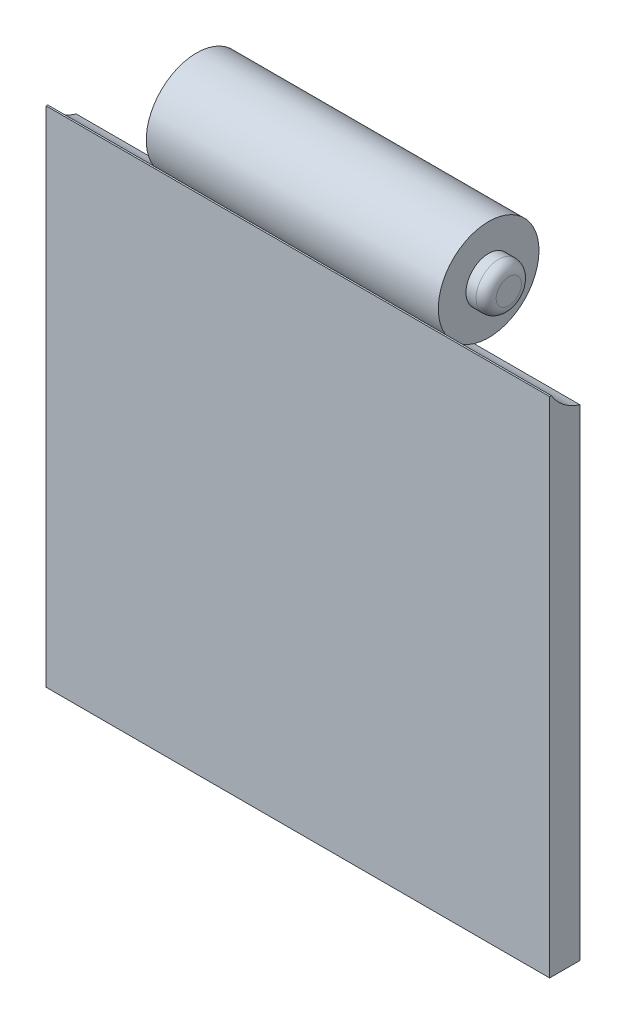
ISO-10303-21;
HEADER;
FILE_DESCRIPTION(('STEP AP214'),'2;1');
FILE_NAME('part.step','',(''),(''),'','','');
FILE_SCHEMA(('AUTOMOTIVE_DESIGN { 1 0 10303 214 1 1 1 1 }'));
ENDSEC;
DATA;
#1=APPLICATION_CONTEXT('core data for automotive mechanical design processes');
#2=APPLICATION_PROTOCOL_DEFINITION('international standard','automotive_design',2000,#1);
#3=PRODUCT_CONTEXT('',#1,'mechanical');
#4=PRODUCT('Part','Part','',(#3));
#5=PRODUCT_RELATED_PRODUCT_CATEGORY('part','',(#4));
#6=PRODUCT_DEFINITION_FORMATION('','',#4);
#7=PRODUCT_DEFINITION_CONTEXT('part definition',#1,'design');
#8=PRODUCT_DEFINITION('design','',#6,#7);
#9=PRODUCT_DEFINITION_SHAPE('','',#8);
#10=(LENGTH_UNIT() NAMED_UNIT(*) SI_UNIT(.MILLI.,.METRE.));
#11=(NAMED_UNIT(*) PLANE_ANGLE_UNIT() SI_UNIT($,.RADIAN.));
#12=(NAMED_UNIT(*) SI_UNIT($,.STERADIAN.) SOLID_ANGLE_UNIT());
#13=UNCERTAINTY_MEASURE_WITH_UNIT(LENGTH_MEASURE(1.E-05),#10,'distance_accuracy_value','');
#14=(GEOMETRIC_REPRESENTATION_CONTEXT(3) GLOBAL_UNCERTAINTY_ASSIGNED_CONTEXT((#13)) GLOBAL_UNIT_ASSIGNED_CONTEXT((#10,
#11,#12)) REPRESENTATION_CONTEXT('',''));
#15=CARTESIAN_POINT('',(0.,0.,0.));
#16=DIRECTION('',(0.,0.,1.));
#17=DIRECTION('',(1.,0.,0.));
#18=AXIS2_PLACEMENT_3D('',#15,#16,#17);
#19=CARTESIAN_POINT('',(-25.,50.,-1.5));
#20=DIRECTION('',(0.,0.,1.));
#21=DIRECTION('',(1.,0.,0.));
#22=AXIS2_PLACEMENT_3D('',#19,#20,#21);
#23=PLANE('',#22);
#24=DIRECTION('',(0.,-1.,0.));
#25=VECTOR('',#24,1.);
#26=CARTESIAN_POINT('',(-25.,50.,-1.5));
#27=LINE('',#26,#25);
#28=CARTESIAN_POINT('',(-25.,47.8014263661463,-1.5));
#29=VERTEX_POINT('',#28);
#30=CARTESIAN_POINT('',(-25.,0.,-1.5));
#31=VERTEX_POINT('',#30);
#32=EDGE_CURVE('E110',#29,#31,#27,.T.);
#33=ORIENTED_EDGE('',*,*,#32,.F.);
#34=DIRECTION('',(1.,0.,0.));
#35=VECTOR('',#34,1.);
#36=CARTESIAN_POINT('',(-25.,47.8014263661463,-1.5));
#37=LINE('',#36,#35);
#38=CARTESIAN_POINT('',(-14.5,47.8014263661463,-1.5));
#39=VERTEX_POINT('',#38);
#40=EDGE_CURVE('E225',#29,#39,#37,.T.);
#41=ORIENTED_EDGE('',*,*,#40,.T.);
#42=DIRECTION('',(1.,0.,0.));
#43=VECTOR('',#42,1.);
#44=CARTESIAN_POINT('',(-14.5,47.8014263661463,-1.5));
#45=LINE('',#44,#43);
#46=CARTESIAN_POINT('',(14.5,47.8014263661463,-1.5));
#47=VERTEX_POINT('',#46);
#48=EDGE_CURVE('E99',#39,#47,#45,.T.);
#49=ORIENTED_EDGE('',*,*,#48,.T.);
#50=DIRECTION('',(-1.,0.,0.));
#51=VECTOR('',#50,1.);
#52=CARTESIAN_POINT('',(25.,47.8014263661463,-1.5));
#53=LINE('',#52,#51);
#54=CARTESIAN_POINT('',(25.,47.8014263661463,-1.5));
#55=VERTEX_POINT('',#54);
#56=EDGE_CURVE('E206',#55,#47,#53,.T.);
#57=ORIENTED_EDGE('',*,*,#56,.F.);
#58=DIRECTION('',(0.,-1.,0.));
#59=VECTOR('',#58,1.);
#60=CARTESIAN_POINT('',(25.,50.,-1.5));
#61=LINE('',#60,#59);
#62=CARTESIAN_POINT('',(25.,0.,-1.5));
#63=VERTEX_POINT('',#62);
#64=EDGE_CURVE('E112',#55,#63,#61,.T.);
#65=ORIENTED_EDGE('',*,*,#64,.T.);
#66=DIRECTION('',(-1.,0.,0.));
#67=VECTOR('',#66,1.);
#68=CARTESIAN_POINT('',(-25.,0.,-1.5));
#69=LINE('',#68,#67);
#70=EDGE_CURVE('E98',#63,#31,#69,.T.);
#71=ORIENTED_EDGE('',*,*,#70,.T.);
#72=EDGE_LOOP('',(#33,#41,#49,#57,#65,#71));
#73=FACE_BOUND('',#72,.T.);
#74=ADVANCED_FACE('F33',(#73),#23,.F.);
#75=CARTESIAN_POINT('',(0.,50.,0.));
#76=DIRECTION('',(0.,1.,0.));
#77=DIRECTION('',(0.,0.,1.));
#78=AXIS2_PLACEMENT_3D('',#75,#76,#77);
#79=PLANE('',#78);
#80=DIRECTION('',(1.,0.,0.));
#81=VECTOR('',#80,1.);
#82=CARTESIAN_POINT('',(-25.,50.,1.33685604506207));
#83=LINE('',#82,#81);
#84=CARTESIAN_POINT('',(-25.,50.,1.33685604506207));
#85=VERTEX_POINT('',#84);
#86=CARTESIAN_POINT('',(-14.5,50.,1.33685604506207));
#87=VERTEX_POINT('',#86);
#88=EDGE_CURVE('E197',#85,#87,#83,.T.);
#89=ORIENTED_EDGE('',*,*,#88,.F.);
#90=DIRECTION('',(0.,0.,1.));
#91=VECTOR('',#90,1.);
#92=CARTESIAN_POINT('',(-25.,50.,-1.5));
#93=LINE('',#92,#91);
#94=CARTESIAN_POINT('',(-25.,50.,1.5));
#95=VERTEX_POINT('',#94);
#96=EDGE_CURVE('E191',#85,#95,#93,.T.);
#97=ORIENTED_EDGE('',*,*,#96,.T.);
#98=DIRECTION('',(1.,0.,0.));
#99=VECTOR('',#98,1.);
#100=CARTESIAN_POINT('',(-25.,50.,1.5));
#101=LINE('',#100,#99);
#102=CARTESIAN_POINT('',(25.,50.,1.5));
#103=VERTEX_POINT('',#102);
#104=EDGE_CURVE('E57',#95,#103,#101,.T.);
#105=ORIENTED_EDGE('',*,*,#104,.T.);
#106=DIRECTION('',(0.,0.,-1.));
#107=VECTOR('',#106,1.);
#108=CARTESIAN_POINT('',(25.,50.,-1.5));
#109=LINE('',#108,#107);
#110=CARTESIAN_POINT('',(25.,50.,1.33685604506206));
#111=VERTEX_POINT('',#110);
#112=EDGE_CURVE('E86',#103,#111,#109,.T.);
#113=ORIENTED_EDGE('',*,*,#112,.T.);
#114=DIRECTION('',(-1.,0.,0.));
#115=VECTOR('',#114,1.);
#116=CARTESIAN_POINT('',(25.,50.,1.33685604506207));
#117=LINE('',#116,#115);
#118=CARTESIAN_POINT('',(14.5,50.,1.33685604506207));
#119=VERTEX_POINT('',#118);
#120=EDGE_CURVE('E48',#111,#119,#117,.T.);
#121=ORIENTED_EDGE('',*,*,#120,.T.);
#122=DIRECTION('',(1.,0.,0.));
#123=VECTOR('',#122,1.);
#124=CARTESIAN_POINT('',(-14.5,50.,1.33685604506207));
#125=LINE('',#124,#123);
#126=EDGE_CURVE('E114',#87,#119,#125,.T.);
#127=ORIENTED_EDGE('',*,*,#126,.F.);
#128=EDGE_LOOP('',(#89,#97,#105,#113,#121,#127));
#129=FACE_BOUND('',#128,.T.);
#130=ADVANCED_FACE('F142',(#129),#79,.T.);
#131=CARTESIAN_POINT('',(25.,50.,-1.5));
#132=DIRECTION('',(-1.,0.,0.));
#133=DIRECTION('',(0.,0.,1.));
#134=AXIS2_PLACEMENT_3D('',#131,#132,#133);
#135=PLANE('',#134);
#136=CARTESIAN_POINT('',(25.,52.5894672323785,-2.94036962731462));
#137=DIRECTION('',(1.,0.,0.));
#138=DIRECTION('',(0.,0.,-1.));
#139=AXIS2_PLACEMENT_3D('',#136,#137,#138);
#140=CIRCLE('',#139,5.);
#141=EDGE_CURVE('E207',#111,#55,#140,.T.);
#142=ORIENTED_EDGE('',*,*,#141,.F.);
#143=ORIENTED_EDGE('',*,*,#112,.F.);
#144=DIRECTION('',(0.,-1.,0.));
#145=VECTOR('',#144,1.);
#146=CARTESIAN_POINT('',(25.,50.,1.5));
#147=LINE('',#146,#145);
#148=CARTESIAN_POINT('',(25.,0.,1.5));
#149=VERTEX_POINT('',#148);
#150=EDGE_CURVE('E79',#103,#149,#147,.T.);
#151=ORIENTED_EDGE('',*,*,#150,.T.);
#152=DIRECTION('',(0.,0.,-1.));
#153=VECTOR('',#152,1.);
#154=CARTESIAN_POINT('',(25.,0.,-1.5));
#155=LINE('',#154,#153);
#156=EDGE_CURVE('E93',#149,#63,#155,.T.);
#157=ORIENTED_EDGE('',*,*,#156,.T.);
#158=ORIENTED_EDGE('',*,*,#64,.F.);
#159=EDGE_LOOP('',(#142,#143,#151,#157,#158));
#160=FACE_BOUND('',#159,.T.);
#161=ADVANCED_FACE('F91',(#160),#135,.F.);
#162=CARTESIAN_POINT('',(14.5,52.5894672323785,-2.94036962731462));
#163=DIRECTION('',(1.,0.,0.));
#164=DIRECTION('',(0.,0.,-1.));
#165=AXIS2_PLACEMENT_3D('',#162,#163,#164);
#166=PLANE('',#165);
#167=CARTESIAN_POINT('',(14.5,52.5894672323785,-2.94036962731462));
#168=DIRECTION('',(1.,0.,0.));
#169=DIRECTION('',(0.,0.,-1.));
#170=AXIS2_PLACEMENT_3D('',#167,#168,#169);
#171=CIRCLE('',#170,5.);
#172=EDGE_CURVE('E216',#119,#47,#171,.T.);
#173=ORIENTED_EDGE('',*,*,#172,.T.);
#174=CARTESIAN_POINT('',(14.5,52.5894672323785,-2.94036962731462));
#175=DIRECTION('',(1.,0.,0.));
#176=DIRECTION('',(0.,0.,-1.));
#177=AXIS2_PLACEMENT_3D('',#174,#175,#176);
#178=CIRCLE('',#177,5.);
#179=EDGE_CURVE('E180',#47,#119,#178,.T.);
#180=ORIENTED_EDGE('',*,*,#179,.T.);
#181=EDGE_LOOP('',(#173,#180));
#182=FACE_BOUND('',#181,.T.);
#183=CARTESIAN_POINT('',(14.5,52.5894672323785,-2.94036962731462));
#184=DIRECTION('',(1.,0.,0.));
#185=DIRECTION('',(0.,0.,-1.));
#186=AXIS2_PLACEMENT_3D('',#183,#184,#185);
#187=CIRCLE('',#186,2.25);
#188=CARTESIAN_POINT('',(14.5,52.5894672323785,-5.19036962731462));
#189=VERTEX_POINT('',#188);
#190=EDGE_CURVE('E178',#189,#189,#187,.T.);
#191=ORIENTED_EDGE('',*,*,#190,.F.);
#192=EDGE_LOOP('',(#191));
#193=FACE_BOUND('',#192,.T.);
#194=ADVANCED_FACE('F155',(#182,#193),#166,.T.);
#195=CARTESIAN_POINT('',(-25.,50.,-1.5));
#196=DIRECTION('',(1.,0.,0.));
#197=DIRECTION('',(0.,0.,-1.));
#198=AXIS2_PLACEMENT_3D('',#195,#196,#197);
#199=PLANE('',#198);
#200=ORIENTED_EDGE('',*,*,#96,.F.);
#201=CARTESIAN_POINT('',(-25.,52.5894672323785,-2.94036962731462));
#202=DIRECTION('',(1.,0.,0.));
#203=DIRECTION('',(0.,0.,-1.));
#204=AXIS2_PLACEMENT_3D('',#201,#202,#203);
#205=CIRCLE('',#204,5.);
#206=EDGE_CURVE('E202',#85,#29,#205,.T.);
#207=ORIENTED_EDGE('',*,*,#206,.T.);
#208=ORIENTED_EDGE('',*,*,#32,.T.);
#209=DIRECTION('',(0.,0.,1.));
#210=VECTOR('',#209,1.);
#211=CARTESIAN_POINT('',(-25.,0.,-1.5));
#212=LINE('',#211,#210);
#213=CARTESIAN_POINT('',(-25.,0.,1.5));
#214=VERTEX_POINT('',#213);
#215=EDGE_CURVE('E87',#31,#214,#212,.T.);
#216=ORIENTED_EDGE('',*,*,#215,.T.);
#217=DIRECTION('',(0.,-1.,0.));
#218=VECTOR('',#217,1.);
#219=CARTESIAN_POINT('',(-25.,50.,1.5));
#220=LINE('',#219,#218);
#221=EDGE_CURVE('E82',#95,#214,#220,.T.);
#222=ORIENTED_EDGE('',*,*,#221,.F.);
#223=EDGE_LOOP('',(#200,#207,#208,#216,#222));
#224=FACE_BOUND('',#223,.T.);
#225=ADVANCED_FACE('F152',(#224),#199,.F.);
#226=CARTESIAN_POINT('',(-25.,50.,1.5));
#227=DIRECTION('',(0.,0.,-1.));
#228=DIRECTION('',(-1.,0.,0.));
#229=AXIS2_PLACEMENT_3D('',#226,#227,#228);
#230=PLANE('',#229);
#231=DIRECTION('',(1.,0.,0.));
#232=VECTOR('',#231,1.);
#233=CARTESIAN_POINT('',(-25.,0.,1.5));
#234=LINE('',#233,#232);
#235=EDGE_CURVE('E76',#214,#149,#234,.T.);
#236=ORIENTED_EDGE('',*,*,#235,.T.);
#237=ORIENTED_EDGE('',*,*,#150,.F.);
#238=ORIENTED_EDGE('',*,*,#104,.F.);
#239=ORIENTED_EDGE('',*,*,#221,.T.);
#240=EDGE_LOOP('',(#236,#237,#238,#239));
#241=FACE_BOUND('',#240,.T.);
#242=ADVANCED_FACE('F78',(#241),#230,.F.);
#243=CARTESIAN_POINT('',(0.,0.,0.));
#244=DIRECTION('',(0.,1.,0.));
#245=DIRECTION('',(0.,0.,1.));
#246=AXIS2_PLACEMENT_3D('',#243,#244,#245);
#247=PLANE('',#246);
#248=ORIENTED_EDGE('',*,*,#156,.F.);
#249=ORIENTED_EDGE('',*,*,#235,.F.);
#250=ORIENTED_EDGE('',*,*,#215,.F.);
#251=ORIENTED_EDGE('',*,*,#70,.F.);
#252=EDGE_LOOP('',(#248,#249,#250,#251));
#253=FACE_BOUND('',#252,.T.);
#254=ADVANCED_FACE('F96',(#253),#247,.F.);
#255=CARTESIAN_POINT('',(-14.5,52.5894672323785,-2.94036962731462));
#256=DIRECTION('',(1.,0.,0.));
#257=DIRECTION('',(0.,0.,-1.));
#258=AXIS2_PLACEMENT_3D('',#255,#256,#257);
#259=CYLINDRICAL_SURFACE('',#258,5.);
#260=ORIENTED_EDGE('',*,*,#48,.F.);
#261=CARTESIAN_POINT('',(-14.5,52.5894672323785,-2.94036962731462));
#262=DIRECTION('',(1.,0.,0.));
#263=DIRECTION('',(0.,0.,-1.));
#264=AXIS2_PLACEMENT_3D('',#261,#262,#263);
#265=CIRCLE('',#264,5.);
#266=EDGE_CURVE('E103',#39,#87,#265,.T.);
#267=ORIENTED_EDGE('',*,*,#266,.T.);
#268=ORIENTED_EDGE('',*,*,#126,.T.);
#269=ORIENTED_EDGE('',*,*,#179,.F.);
#270=EDGE_LOOP('',(#260,#267,#268,#269));
#271=FACE_BOUND('',#270,.T.);
#272=ADVANCED_FACE('F233',(#271),#259,.T.);
#273=CARTESIAN_POINT('',(-14.5,52.5894672323785,-2.94036962731462));
#274=DIRECTION('',(1.,0.,0.));
#275=DIRECTION('',(0.,0.,-1.));
#276=AXIS2_PLACEMENT_3D('',#273,#274,#275);
#277=PLANE('',#276);
#278=CARTESIAN_POINT('',(-14.5,52.5894672323785,-2.94036962731462));
#279=DIRECTION('',(1.,0.,0.));
#280=DIRECTION('',(0.,0.,-1.));
#281=AXIS2_PLACEMENT_3D('',#278,#279,#280);
#282=CIRCLE('',#281,2.25);
#283=CARTESIAN_POINT('',(-14.5,52.5894672323785,-5.19036962731462));
#284=VERTEX_POINT('',#283);
#285=EDGE_CURVE('E181',#284,#284,#282,.T.);
#286=ORIENTED_EDGE('',*,*,#285,.T.);
#287=EDGE_LOOP('',(#286));
#288=FACE_BOUND('',#287,.T.);
#289=ORIENTED_EDGE('',*,*,#266,.F.);
#290=CARTESIAN_POINT('',(-14.5,52.5894672323785,-2.94036962731462));
#291=DIRECTION('',(1.,0.,0.));
#292=DIRECTION('',(0.,0.,-1.));
#293=AXIS2_PLACEMENT_3D('',#290,#291,#292);
#294=CIRCLE('',#293,5.);
#295=EDGE_CURVE('E224',#87,#39,#294,.T.);
#296=ORIENTED_EDGE('',*,*,#295,.F.);
#297=EDGE_LOOP('',(#289,#296));
#298=FACE_BOUND('',#297,.T.);
#299=ADVANCED_FACE('F174',(#288,#298),#277,.F.);
#300=CARTESIAN_POINT('',(16.5,52.5894672323785,-2.94036962731462));
#301=DIRECTION('',(-1.,0.,0.));
#302=DIRECTION('',(0.,0.,1.));
#303=AXIS2_PLACEMENT_3D('',#300,#301,#302);
#304=CYLINDRICAL_SURFACE('',#303,2.25);
#305=CARTESIAN_POINT('',(15.5,52.5894672323785,-2.94036962731462));
#306=DIRECTION('',(1.,0.,0.));
#307=DIRECTION('',(0.,0.,-1.));
#308=AXIS2_PLACEMENT_3D('',#305,#306,#307);
#309=CIRCLE('',#308,2.25);
#310=CARTESIAN_POINT('',(15.5,52.5894672323785,-5.19036962731462));
#311=VERTEX_POINT('',#310);
#312=EDGE_CURVE('E120',#311,#311,#309,.F.);
#313=ORIENTED_EDGE('',*,*,#312,.T.);
#314=EDGE_LOOP('',(#313));
#315=FACE_BOUND('',#314,.T.);
#316=ORIENTED_EDGE('',*,*,#190,.T.);
#317=EDGE_LOOP('',(#316));
#318=FACE_BOUND('',#317,.T.);
#319=ADVANCED_FACE('F165',(#315,#318),#304,.T.);
#320=CARTESIAN_POINT('',(16.5,52.5894672323785,-2.94036962731462));
#321=DIRECTION('',(1.,0.,0.));
#322=DIRECTION('',(0.,0.,-1.));
#323=AXIS2_PLACEMENT_3D('',#320,#321,#322);
#324=PLANE('',#323);
#325=CARTESIAN_POINT('',(16.5,52.5894672323785,-2.94036962731462));
#326=DIRECTION('',(1.,0.,0.));
#327=DIRECTION('',(0.,0.,-1.));
#328=AXIS2_PLACEMENT_3D('',#325,#326,#327);
#329=CIRCLE('',#328,1.25);
#330=CARTESIAN_POINT('',(16.5,52.5894672323785,-4.19036962731462));
#331=VERTEX_POINT('',#330);
#332=EDGE_CURVE('E117',#331,#331,#329,.T.);
#333=ORIENTED_EDGE('',*,*,#332,.T.);
#334=EDGE_LOOP('',(#333));
#335=FACE_BOUND('',#334,.T.);
#336=ADVANCED_FACE('F158',(#335),#324,.T.);
#337=CARTESIAN_POINT('',(15.5,52.5894672323785,-2.94036962731462));
#338=DIRECTION('',(1.,0.,0.));
#339=DIRECTION('',(0.,0.,-1.));
#340=AXIS2_PLACEMENT_3D('',#337,#338,#339);
#341=TOROIDAL_SURFACE('',#340,1.25,1.);
#342=ORIENTED_EDGE('',*,*,#312,.F.);
#343=EDGE_LOOP('',(#342));
#344=FACE_BOUND('',#343,.T.);
#345=ORIENTED_EDGE('',*,*,#332,.F.);
#346=EDGE_LOOP('',(#345));
#347=FACE_BOUND('',#346,.T.);
#348=ADVANCED_FACE('F156',(#344,#347),#341,.T.);
#349=CARTESIAN_POINT('',(-16.5,52.5894672323785,-2.94036962731462));
#350=DIRECTION('',(1.,0.,0.));
#351=DIRECTION('',(0.,0.,-1.));
#352=AXIS2_PLACEMENT_3D('',#349,#350,#351);
#353=CYLINDRICAL_SURFACE('',#352,2.25);
#354=CARTESIAN_POINT('',(-15.5,52.5894672323785,-2.94036962731462));
#355=DIRECTION('',(-1.,0.,0.));
#356=DIRECTION('',(0.,0.,1.));
#357=AXIS2_PLACEMENT_3D('',#354,#355,#356);
#358=CIRCLE('',#357,2.25);
#359=CARTESIAN_POINT('',(-15.5,52.5894672323785,-0.690369627314624));
#360=VERTEX_POINT('',#359);
#361=EDGE_CURVE('E41',#360,#360,#358,.F.);
#362=ORIENTED_EDGE('',*,*,#361,.T.);
#363=EDGE_LOOP('',(#362));
#364=FACE_BOUND('',#363,.T.);
#365=ORIENTED_EDGE('',*,*,#285,.F.);
#366=EDGE_LOOP('',(#365));
#367=FACE_BOUND('',#366,.T.);
#368=ADVANCED_FACE('F125',(#364,#367),#353,.T.);
#369=CARTESIAN_POINT('',(-16.5,52.5894672323785,-2.94036962731462));
#370=DIRECTION('',(-1.,0.,0.));
#371=DIRECTION('',(0.,0.,-1.));
#372=AXIS2_PLACEMENT_3D('',#369,#370,#371);
#373=PLANE('',#372);
#374=CARTESIAN_POINT('',(-16.5,52.5894672323785,-2.94036962731462));
#375=DIRECTION('',(-1.,0.,0.));
#376=DIRECTION('',(0.,0.,1.));
#377=AXIS2_PLACEMENT_3D('',#374,#375,#376);
#378=CIRCLE('',#377,1.25);
#379=CARTESIAN_POINT('',(-16.5,52.5894672323785,-1.69036962731462));
#380=VERTEX_POINT('',#379);
#381=EDGE_CURVE('E11',#380,#380,#378,.T.);
#382=ORIENTED_EDGE('',*,*,#381,.T.);
#383=EDGE_LOOP('',(#382));
#384=FACE_BOUND('',#383,.T.);
#385=ADVANCED_FACE('F130',(#384),#373,.T.);
#386=CARTESIAN_POINT('',(-15.5,52.5894672323785,-2.94036962731462));
#387=DIRECTION('',(-1.,0.,0.));
#388=DIRECTION('',(0.,0.,1.));
#389=AXIS2_PLACEMENT_3D('',#386,#387,#388);
#390=TOROIDAL_SURFACE('',#389,1.25,1.);
#391=ORIENTED_EDGE('',*,*,#381,.F.);
#392=EDGE_LOOP('',(#391));
#393=FACE_BOUND('',#392,.T.);
#394=ORIENTED_EDGE('',*,*,#361,.F.);
#395=EDGE_LOOP('',(#394));
#396=FACE_BOUND('',#395,.T.);
#397=ADVANCED_FACE('F35',(#393,#396),#390,.T.);
#398=CARTESIAN_POINT('',(25.,52.5894672323785,-2.94036962731462));
#399=DIRECTION('',(-1.,0.,0.));
#400=DIRECTION('',(0.,0.,1.));
#401=AXIS2_PLACEMENT_3D('',#398,#399,#400);
#402=CYLINDRICAL_SURFACE('',#401,5.);
#403=ORIENTED_EDGE('',*,*,#172,.F.);
#404=ORIENTED_EDGE('',*,*,#120,.F.);
#405=ORIENTED_EDGE('',*,*,#141,.T.);
#406=ORIENTED_EDGE('',*,*,#56,.T.);
#407=EDGE_LOOP('',(#403,#404,#405,#406));
#408=FACE_BOUND('',#407,.T.);
#409=ADVANCED_FACE('F129',(#408),#402,.F.);
#410=CARTESIAN_POINT('',(-25.,52.5894672323785,-2.94036962731462));
#411=DIRECTION('',(1.,0.,0.));
#412=DIRECTION('',(0.,0.,-1.));
#413=AXIS2_PLACEMENT_3D('',#410,#411,#412);
#414=CYLINDRICAL_SURFACE('',#413,5.);
#415=ORIENTED_EDGE('',*,*,#295,.T.);
#416=ORIENTED_EDGE('',*,*,#40,.F.);
#417=ORIENTED_EDGE('',*,*,#206,.F.);
#418=ORIENTED_EDGE('',*,*,#88,.T.);
#419=EDGE_LOOP('',(#415,#416,#417,#418));
#420=FACE_BOUND('',#419,.T.);
#421=ADVANCED_FACE('F136',(#420),#414,.F.);
#422=CLOSED_SHELL('',(#74,#130,#161,#194,#225,#242,#254,#272,#299,#319,#336,#348,#368,#385,#397,
#409,#421));
#423=MANIFOLD_SOLID_BREP('B2',#422);
#424=ADVANCED_BREP_SHAPE_REPRESENTATION('',(#18,#423),#14);
#425=SHAPE_DEFINITION_REPRESENTATION(#9,#424);
ENDSEC;
END-ISO-10303-21;
